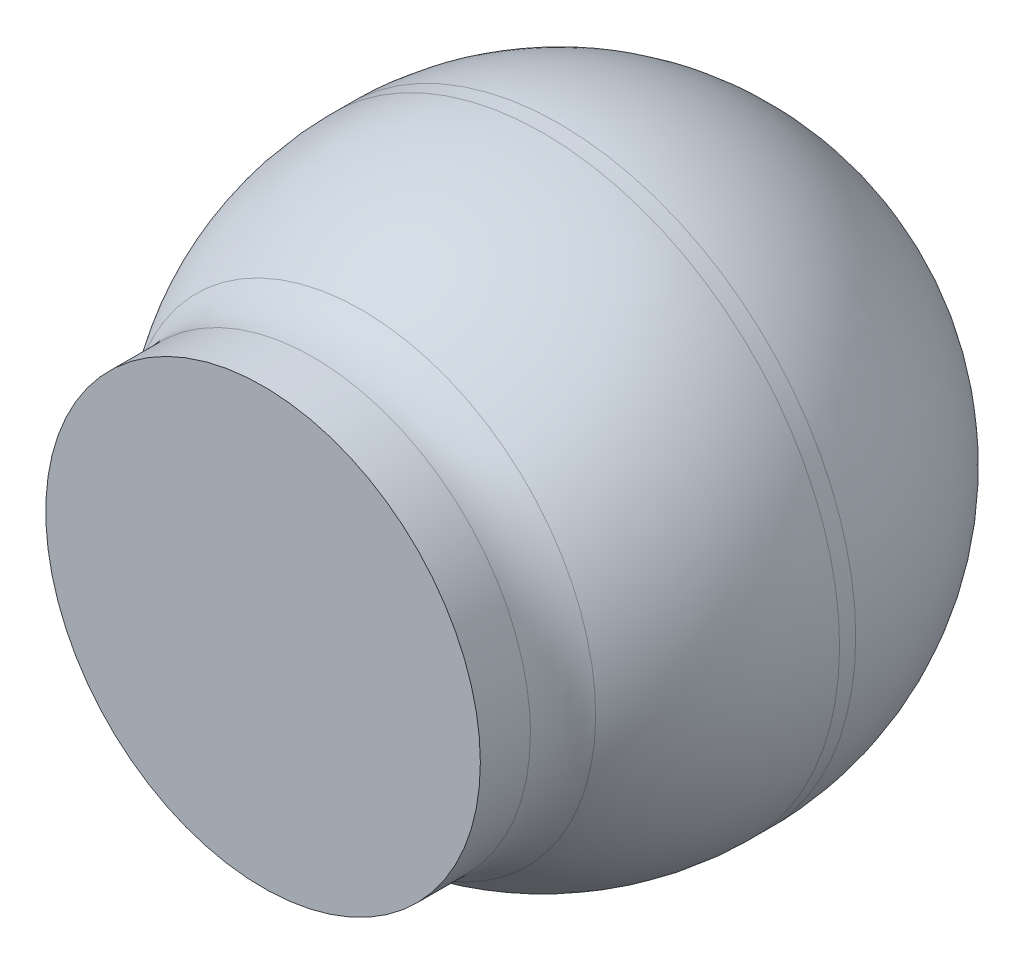
ISO-10303-21;
HEADER;
FILE_DESCRIPTION(('STEP AP214'),'2;1');
FILE_NAME('part.step','',(''),(''),'','','');
FILE_SCHEMA(('AUTOMOTIVE_DESIGN { 1 0 10303 214 1 1 1 1 }'));
ENDSEC;
DATA;
#1=APPLICATION_CONTEXT('core data for automotive mechanical design processes');
#2=APPLICATION_PROTOCOL_DEFINITION('international standard','automotive_design',2000,#1);
#3=PRODUCT_CONTEXT('',#1,'mechanical');
#4=PRODUCT('Part','Part','',(#3));
#5=PRODUCT_RELATED_PRODUCT_CATEGORY('part','',(#4));
#6=PRODUCT_DEFINITION_FORMATION('','',#4);
#7=PRODUCT_DEFINITION_CONTEXT('part definition',#1,'design');
#8=PRODUCT_DEFINITION('design','',#6,#7);
#9=PRODUCT_DEFINITION_SHAPE('','',#8);
#10=(LENGTH_UNIT() NAMED_UNIT(*) SI_UNIT(.MILLI.,.METRE.));
#11=(NAMED_UNIT(*) PLANE_ANGLE_UNIT() SI_UNIT($,.RADIAN.));
#12=(NAMED_UNIT(*) SI_UNIT($,.STERADIAN.) SOLID_ANGLE_UNIT());
#13=UNCERTAINTY_MEASURE_WITH_UNIT(LENGTH_MEASURE(1.E-05),#10,'distance_accuracy_value','');
#14=(GEOMETRIC_REPRESENTATION_CONTEXT(3) GLOBAL_UNCERTAINTY_ASSIGNED_CONTEXT((#13)) GLOBAL_UNIT_ASSIGNED_CONTEXT((#10,
#11,#12)) REPRESENTATION_CONTEXT('',''));
#15=CARTESIAN_POINT('',(0.,0.,0.));
#16=DIRECTION('',(0.,0.,1.));
#17=DIRECTION('',(1.,0.,0.));
#18=AXIS2_PLACEMENT_3D('',#15,#16,#17);
#19=CARTESIAN_POINT('',(-8.182919922269,-0.241349291452,10.006534503384));
#20=DIRECTION('',(0.,0.,-1.));
#21=DIRECTION('',(-1.,0.,0.));
#22=AXIS2_PLACEMENT_3D('',#19,#20,#21);
#23=PLANE('',#22);
#24=CARTESIAN_POINT('',(-8.182919922269,-0.241349291452,10.006534503384));
#25=DIRECTION('',(0.,0.,1.));
#26=DIRECTION('',(1.,0.,0.));
#27=AXIS2_PLACEMENT_3D('',#24,#25,#26);
#28=CIRCLE('',#27,0.275);
#29=CARTESIAN_POINT('',(-7.907919922269,-0.241349291452,10.006534503384));
#30=VERTEX_POINT('',#29);
#31=EDGE_CURVE('E20',#30,#30,#28,.F.);
#32=ORIENTED_EDGE('',*,*,#31,.F.);
#33=EDGE_LOOP('',(#32));
#34=FACE_BOUND('',#33,.T.);
#35=ADVANCED_FACE('F17',(#34),#23,.F.);
#36=CARTESIAN_POINT('',(-8.182919922269,-0.241349291452,9.906534503384));
#37=DIRECTION('',(0.,0.,1.));
#38=DIRECTION('',(1.,0.,0.));
#39=AXIS2_PLACEMENT_3D('',#36,#37,#38);
#40=CYLINDRICAL_SURFACE('',#39,0.275);
#41=CARTESIAN_POINT('',(-8.182919922269,-0.241349291452,9.943180457728));
#42=DIRECTION('',(0.,0.,-1.));
#43=DIRECTION('',(0.996700902337582,0.0811622527992459,0.));
#44=AXIS2_PLACEMENT_3D('',#41,#42,#43);
#45=CIRCLE('',#44,0.275000000000001);
#46=CARTESIAN_POINT('',(-7.90882717412616,-0.219029671932207,9.943180457728));
#47=VERTEX_POINT('',#46);
#48=EDGE_CURVE('E65',#47,#47,#45,.F.);
#49=ORIENTED_EDGE('',*,*,#48,.T.);
#50=EDGE_LOOP('',(#49));
#51=FACE_BOUND('',#50,.T.);
#52=ORIENTED_EDGE('',*,*,#31,.T.);
#53=EDGE_LOOP('',(#52));
#54=FACE_BOUND('',#53,.T.);
#55=ADVANCED_FACE('F62',(#51,#54),#40,.T.);
#56=CARTESIAN_POINT('',(-8.182919922269,-0.241349291452,9.943180457728));
#57=DIRECTION('',(0.,0.,-1.));
#58=DIRECTION('',(0.996700902337583,0.081162252799246,0.));
#59=AXIS2_PLACEMENT_3D('',#56,#57,#58);
#60=TOROIDAL_SURFACE('',#59,0.375,0.1);
#61=ORIENTED_EDGE('',*,*,#48,.F.);
#62=EDGE_LOOP('',(#61));
#63=FACE_BOUND('',#62,.T.);
#64=CARTESIAN_POINT('',(-8.182919922269,-0.241349291452,9.881744931236));
#65=DIRECTION('',(0.,0.,-1.));
#66=DIRECTION('',(-0.996700902337598,-0.0811622527990612,0.));
#67=AXIS2_PLACEMENT_3D('',#64,#65,#66);
#68=CIRCLE('',#67,0.296097046412663);
#69=CARTESIAN_POINT('',(-8.478040115608,-0.265381194786,9.881744931236));
#70=VERTEX_POINT('',#69);
#71=EDGE_CURVE('E39',#70,#70,#68,.T.);
#72=ORIENTED_EDGE('',*,*,#71,.F.);
#73=EDGE_LOOP('',(#72));
#74=FACE_BOUND('',#73,.T.);
#75=ADVANCED_FACE('F57',(#63,#74),#60,.F.);
#76=CARTESIAN_POINT('',(-8.556682760645,-0.271785136252,9.651976062157));
#77=CARTESIAN_POINT('',(-8.556682760645,-0.271785136252,9.701461392103));
#78=CARTESIAN_POINT('',(-8.548526217348,-0.271120941579,9.750947004335));
#79=CARTESIAN_POINT('',(-8.532207085349,-0.269792059952,9.798626332798));
#80=CARTESIAN_POINT('',(-8.508341390838,-0.267848654938,9.842699544317));
#81=CARTESIAN_POINT('',(-8.478040115608,-0.265381194786,9.881744931236));
#82=(BOUNDED_CURVE() B_SPLINE_CURVE(5,(#76,#77,#78,#79,#80,#81),.UNSPECIFIED.,.F.,
.F.) B_SPLINE_CURVE_WITH_KNOTS((6,6),(0.,0.661568582165),
.UNSPECIFIED.) CURVE() GEOMETRIC_REPRESENTATION_ITEM() RATIONAL_B_SPLINE_CURVE((1.,1.,1.,1.,1.,1.)) REPRESENTATION_ITEM(''));
#83=CARTESIAN_POINT('',(-8.182919922269,-0.241349291452,9.651976062157));
#84=DIRECTION('',(0.,0.,-1.));
#85=AXIS1_PLACEMENT('',#83,#84);
#86=SURFACE_OF_REVOLUTION('',#82,#85);
#87=CARTESIAN_POINT('',(-8.182919922269,-0.241349291452,9.651976062157));
#88=DIRECTION('',(0.,0.,1.));
#89=DIRECTION('',(1.,0.,0.));
#90=AXIS2_PLACEMENT_3D('',#87,#88,#89);
#91=CIRCLE('',#90,0.375);
#92=CARTESIAN_POINT('',(-7.807919922269,-0.241349291452,9.651976062157));
#93=VERTEX_POINT('',#92);
#94=EDGE_CURVE('E36',#93,#93,#91,.F.);
#95=ORIENTED_EDGE('',*,*,#94,.F.);
#96=EDGE_LOOP('',(#95));
#97=FACE_BOUND('',#96,.T.);
#98=ORIENTED_EDGE('',*,*,#71,.T.);
#99=EDGE_LOOP('',(#98));
#100=FACE_BOUND('',#99,.T.);
#101=ADVANCED_FACE('F53',(#97,#100),#86,.F.);
#102=CARTESIAN_POINT('',(-8.182919922269,-0.241349291452,9.256534503384));
#103=DIRECTION('',(0.,0.,1.));
#104=DIRECTION('',(1.,0.,0.));
#105=AXIS2_PLACEMENT_3D('',#102,#103,#104);
#106=CYLINDRICAL_SURFACE('',#105,0.375);
#107=CARTESIAN_POINT('',(-8.182919922269,-0.241349291452,9.631534503384));
#108=DIRECTION('',(0.,0.,-1.));
#109=DIRECTION('',(0.0811622527992356,-0.996700902337583,0.));
#110=AXIS2_PLACEMENT_3D('',#107,#108,#109);
#111=CIRCLE('',#110,0.375);
#112=CARTESIAN_POINT('',(-8.15248407746929,-0.615112129828594,9.631534503384));
#113=VERTEX_POINT('',#112);
#114=CARTESIAN_POINT('',(-8.21335576706871,0.132413546924594,9.631534503384));
#115=VERTEX_POINT('',#114);
#116=EDGE_CURVE('E11',#113,#115,#111,.T.);
#117=ORIENTED_EDGE('',*,*,#116,.F.);
#118=CARTESIAN_POINT('',(-8.182919922269,-0.241349291452,9.631534503384));
#119=DIRECTION('',(3.33436315446763E-12,2.72100352061447E-13,1.));
#120=DIRECTION('',(0.0811622527992365,-0.996700902337583,0.));
#121=AXIS2_PLACEMENT_3D('',#118,#119,#120);
#122=CIRCLE('',#121,0.375);
#123=EDGE_CURVE('E25',#115,#113,#122,.F.);
#124=ORIENTED_EDGE('',*,*,#123,.F.);
#125=EDGE_LOOP('',(#117,#124));
#126=FACE_BOUND('',#125,.T.);
#127=ORIENTED_EDGE('',*,*,#94,.T.);
#128=EDGE_LOOP('',(#127));
#129=FACE_BOUND('',#128,.T.);
#130=ADVANCED_FACE('F34',(#126,#129),#106,.T.);
#131=CARTESIAN_POINT('',(-8.182919922269,-0.241349291452,9.631534503384));
#132=DIRECTION('',(0.0811622527992361,-0.996700902337583,0.));
#133=DIRECTION('',(-0.996700902337583,-0.0811622527992361,0.));
#134=AXIS2_PLACEMENT_3D('',#131,#132,#133);
#135=SPHERICAL_SURFACE('',#134,0.375);
#136=ORIENTED_EDGE('',*,*,#123,.T.);
#137=ORIENTED_EDGE('',*,*,#116,.T.);
#138=EDGE_LOOP('',(#136,#137));
#139=FACE_BOUND('',#138,.T.);
#140=ADVANCED_FACE('F32',(#139),#135,.T.);
#141=CLOSED_SHELL('',(#35,#55,#75,#101,#130,#140));
#142=MANIFOLD_SOLID_BREP('B1',#141);
#143=ADVANCED_BREP_SHAPE_REPRESENTATION('',(#18,#142),#14);
#144=SHAPE_DEFINITION_REPRESENTATION(#9,#143);
ENDSEC;
END-ISO-10303-21;
